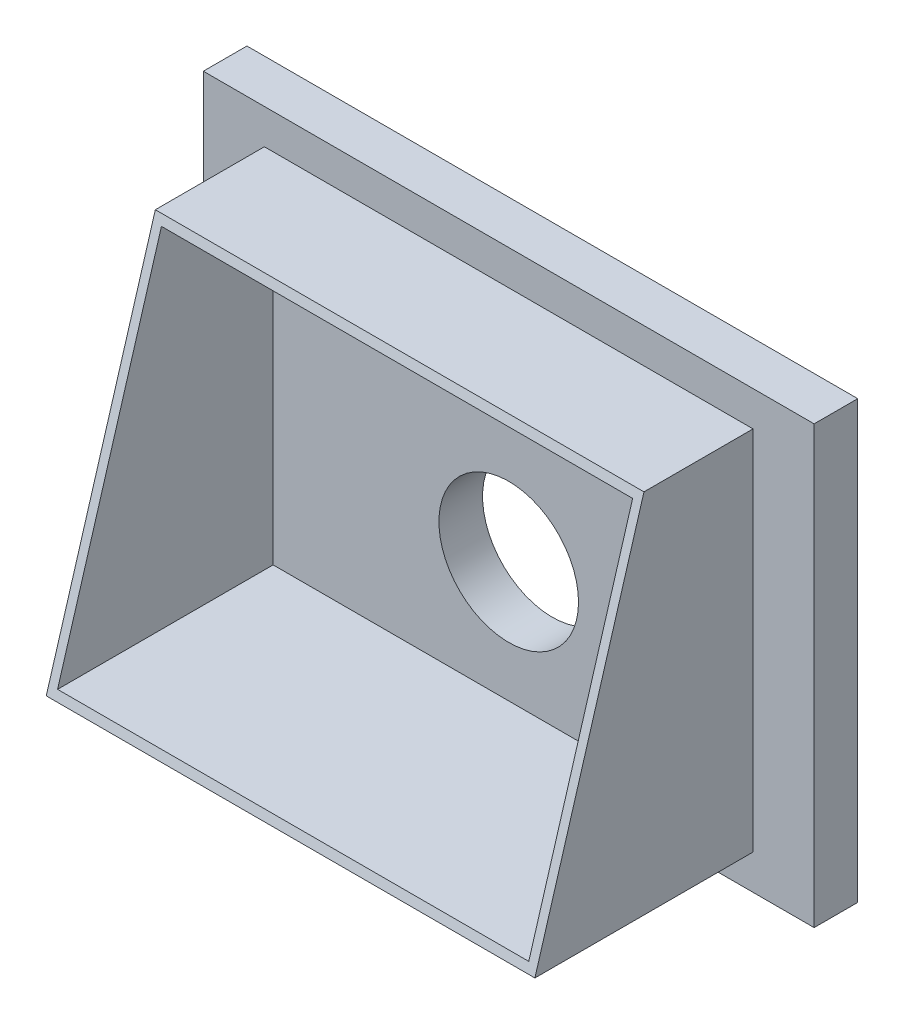
ISO-10303-21;
HEADER;
FILE_DESCRIPTION(('STEP AP214'),'2;1');
FILE_NAME('part.step','',(''),(''),'','','');
FILE_SCHEMA(('AUTOMOTIVE_DESIGN { 1 0 10303 214 1 1 1 1 }'));
ENDSEC;
DATA;
#1=APPLICATION_CONTEXT('core data for automotive mechanical design processes');
#2=APPLICATION_PROTOCOL_DEFINITION('international standard','automotive_design',2000,#1);
#3=PRODUCT_CONTEXT('',#1,'mechanical');
#4=PRODUCT('Part','Part','',(#3));
#5=PRODUCT_RELATED_PRODUCT_CATEGORY('part','',(#4));
#6=PRODUCT_DEFINITION_FORMATION('','',#4);
#7=PRODUCT_DEFINITION_CONTEXT('part definition',#1,'design');
#8=PRODUCT_DEFINITION('design','',#6,#7);
#9=PRODUCT_DEFINITION_SHAPE('','',#8);
#10=(LENGTH_UNIT() NAMED_UNIT(*) SI_UNIT(.MILLI.,.METRE.));
#11=(NAMED_UNIT(*) PLANE_ANGLE_UNIT() SI_UNIT($,.RADIAN.));
#12=(NAMED_UNIT(*) SI_UNIT($,.STERADIAN.) SOLID_ANGLE_UNIT());
#13=UNCERTAINTY_MEASURE_WITH_UNIT(LENGTH_MEASURE(1.E-05),#10,'distance_accuracy_value','');
#14=(GEOMETRIC_REPRESENTATION_CONTEXT(3) GLOBAL_UNCERTAINTY_ASSIGNED_CONTEXT((#13)) GLOBAL_UNIT_ASSIGNED_CONTEXT((#10,
#11,#12)) REPRESENTATION_CONTEXT('',''));
#15=CARTESIAN_POINT('',(0.,0.,0.));
#16=DIRECTION('',(0.,0.,1.));
#17=DIRECTION('',(1.,0.,0.));
#18=AXIS2_PLACEMENT_3D('',#15,#16,#17);
#19=CARTESIAN_POINT('',(0.,0.,50.));
#20=DIRECTION('',(0.,0.,1.));
#21=DIRECTION('',(1.,0.,0.));
#22=AXIS2_PLACEMENT_3D('',#19,#20,#21);
#23=PLANE('',#22);
#24=DIRECTION('',(0.,1.,0.));
#25=VECTOR('',#24,1.);
#26=CARTESIAN_POINT('',(349.999999999998,250.,50.));
#27=LINE('',#26,#25);
#28=CARTESIAN_POINT('',(349.999999999996,-250.,50.));
#29=VERTEX_POINT('',#28);
#30=CARTESIAN_POINT('',(349.999999999998,250.,50.));
#31=VERTEX_POINT('',#30);
#32=EDGE_CURVE('E184',#29,#31,#27,.T.);
#33=ORIENTED_EDGE('',*,*,#32,.T.);
#34=DIRECTION('',(-1.,0.,0.));
#35=VECTOR('',#34,1.);
#36=CARTESIAN_POINT('',(-350.000000000003,250.,50.));
#37=LINE('',#36,#35);
#38=CARTESIAN_POINT('',(-350.000000000003,250.,50.));
#39=VERTEX_POINT('',#38);
#40=EDGE_CURVE('E187',#31,#39,#37,.T.);
#41=ORIENTED_EDGE('',*,*,#40,.T.);
#42=DIRECTION('',(0.,-1.,0.));
#43=VECTOR('',#42,1.);
#44=CARTESIAN_POINT('',(-350.000000000003,250.,50.));
#45=LINE('',#44,#43);
#46=CARTESIAN_POINT('',(-350.000000000003,-250.,50.));
#47=VERTEX_POINT('',#46);
#48=EDGE_CURVE('E190',#39,#47,#45,.T.);
#49=ORIENTED_EDGE('',*,*,#48,.T.);
#50=DIRECTION('',(1.,0.,0.));
#51=VECTOR('',#50,1.);
#52=CARTESIAN_POINT('',(-350.000000000003,-250.,50.));
#53=LINE('',#52,#51);
#54=EDGE_CURVE('E192',#47,#29,#53,.T.);
#55=ORIENTED_EDGE('',*,*,#54,.T.);
#56=EDGE_LOOP('',(#33,#41,#49,#55));
#57=FACE_BOUND('',#56,.T.);
#58=DIRECTION('',(-1.,0.,0.));
#59=VECTOR('',#58,1.);
#60=CARTESIAN_POINT('',(-270.,210.,50.));
#61=LINE('',#60,#59);
#62=CARTESIAN_POINT('',(280.,210.,50.));
#63=VERTEX_POINT('',#62);
#64=CARTESIAN_POINT('',(-280.,210.,50.));
#65=VERTEX_POINT('',#64);
#66=EDGE_CURVE('E237',#63,#65,#61,.T.);
#67=ORIENTED_EDGE('',*,*,#66,.F.);
#68=DIRECTION('',(0.,1.,0.));
#69=VECTOR('',#68,1.);
#70=CARTESIAN_POINT('',(280.,200.,50.));
#71=LINE('',#70,#69);
#72=CARTESIAN_POINT('',(280.,-210.,50.));
#73=VERTEX_POINT('',#72);
#74=EDGE_CURVE('E238',#73,#63,#71,.T.);
#75=ORIENTED_EDGE('',*,*,#74,.F.);
#76=DIRECTION('',(1.,0.,0.));
#77=VECTOR('',#76,1.);
#78=CARTESIAN_POINT('',(-270.,-210.,50.));
#79=LINE('',#78,#77);
#80=CARTESIAN_POINT('',(-280.,-210.,50.));
#81=VERTEX_POINT('',#80);
#82=EDGE_CURVE('E162',#81,#73,#79,.T.);
#83=ORIENTED_EDGE('',*,*,#82,.F.);
#84=DIRECTION('',(0.,-1.,0.));
#85=VECTOR('',#84,1.);
#86=CARTESIAN_POINT('',(-280.,200.,50.));
#87=LINE('',#86,#85);
#88=EDGE_CURVE('E239',#65,#81,#87,.T.);
#89=ORIENTED_EDGE('',*,*,#88,.F.);
#90=EDGE_LOOP('',(#67,#75,#83,#89));
#91=FACE_BOUND('',#90,.T.);
#92=ADVANCED_FACE('F66',(#57,#91),#23,.T.);
#93=CARTESIAN_POINT('',(349.999999999998,250.,50.));
#94=DIRECTION('',(-1.,0.,0.));
#95=DIRECTION('',(0.,-1.,0.));
#96=AXIS2_PLACEMENT_3D('',#93,#94,#95);
#97=PLANE('',#96);
#98=DIRECTION('',(0.,1.,0.));
#99=VECTOR('',#98,1.);
#100=CARTESIAN_POINT('',(349.999999999998,250.,0.));
#101=LINE('',#100,#99);
#102=CARTESIAN_POINT('',(349.999999999996,-250.,0.));
#103=VERTEX_POINT('',#102);
#104=CARTESIAN_POINT('',(349.999999999998,250.,0.));
#105=VERTEX_POINT('',#104);
#106=EDGE_CURVE('E183',#103,#105,#101,.T.);
#107=ORIENTED_EDGE('',*,*,#106,.T.);
#108=DIRECTION('',(0.,0.,-1.));
#109=VECTOR('',#108,1.);
#110=CARTESIAN_POINT('',(349.999999999998,250.,50.));
#111=LINE('',#110,#109);
#112=EDGE_CURVE('E74',#31,#105,#111,.T.);
#113=ORIENTED_EDGE('',*,*,#112,.F.);
#114=ORIENTED_EDGE('',*,*,#32,.F.);
#115=DIRECTION('',(0.,0.,-1.));
#116=VECTOR('',#115,1.);
#117=CARTESIAN_POINT('',(349.999999999996,-250.,50.));
#118=LINE('',#117,#116);
#119=EDGE_CURVE('E194',#29,#103,#118,.T.);
#120=ORIENTED_EDGE('',*,*,#119,.T.);
#121=EDGE_LOOP('',(#107,#113,#114,#120));
#122=FACE_BOUND('',#121,.T.);
#123=ADVANCED_FACE('F68',(#122),#97,.F.);
#124=CARTESIAN_POINT('',(-350.000000000003,250.,50.));
#125=DIRECTION('',(0.,-1.,0.));
#126=DIRECTION('',(0.,0.,-1.));
#127=AXIS2_PLACEMENT_3D('',#124,#125,#126);
#128=PLANE('',#127);
#129=DIRECTION('',(-1.,0.,0.));
#130=VECTOR('',#129,1.);
#131=CARTESIAN_POINT('',(-350.000000000003,250.,0.));
#132=LINE('',#131,#130);
#133=CARTESIAN_POINT('',(-350.000000000003,250.,0.));
#134=VERTEX_POINT('',#133);
#135=EDGE_CURVE('E197',#105,#134,#132,.T.);
#136=ORIENTED_EDGE('',*,*,#135,.T.);
#137=DIRECTION('',(0.,0.,-1.));
#138=VECTOR('',#137,1.);
#139=CARTESIAN_POINT('',(-350.000000000003,250.,50.));
#140=LINE('',#139,#138);
#141=EDGE_CURVE('E207',#39,#134,#140,.T.);
#142=ORIENTED_EDGE('',*,*,#141,.F.);
#143=ORIENTED_EDGE('',*,*,#40,.F.);
#144=ORIENTED_EDGE('',*,*,#112,.T.);
#145=EDGE_LOOP('',(#136,#142,#143,#144));
#146=FACE_BOUND('',#145,.T.);
#147=ADVANCED_FACE('F212',(#146),#128,.F.);
#148=CARTESIAN_POINT('',(-350.000000000003,250.,50.));
#149=DIRECTION('',(1.,0.,0.));
#150=DIRECTION('',(0.,0.,-1.));
#151=AXIS2_PLACEMENT_3D('',#148,#149,#150);
#152=PLANE('',#151);
#153=DIRECTION('',(0.,-1.,0.));
#154=VECTOR('',#153,1.);
#155=CARTESIAN_POINT('',(-350.000000000003,250.,0.));
#156=LINE('',#155,#154);
#157=CARTESIAN_POINT('',(-350.000000000003,-250.,0.));
#158=VERTEX_POINT('',#157);
#159=EDGE_CURVE('E199',#134,#158,#156,.T.);
#160=ORIENTED_EDGE('',*,*,#159,.T.);
#161=DIRECTION('',(0.,0.,-1.));
#162=VECTOR('',#161,1.);
#163=CARTESIAN_POINT('',(-350.000000000003,-250.,50.));
#164=LINE('',#163,#162);
#165=EDGE_CURVE('E204',#47,#158,#164,.T.);
#166=ORIENTED_EDGE('',*,*,#165,.F.);
#167=ORIENTED_EDGE('',*,*,#48,.F.);
#168=ORIENTED_EDGE('',*,*,#141,.T.);
#169=EDGE_LOOP('',(#160,#166,#167,#168));
#170=FACE_BOUND('',#169,.T.);
#171=ADVANCED_FACE('F224',(#170),#152,.F.);
#172=CARTESIAN_POINT('',(-350.000000000003,-250.,50.));
#173=DIRECTION('',(0.,1.,0.));
#174=DIRECTION('',(0.,0.,1.));
#175=AXIS2_PLACEMENT_3D('',#172,#173,#174);
#176=PLANE('',#175);
#177=DIRECTION('',(1.,0.,0.));
#178=VECTOR('',#177,1.);
#179=CARTESIAN_POINT('',(-350.000000000003,-250.,0.));
#180=LINE('',#179,#178);
#181=EDGE_CURVE('E188',#158,#103,#180,.T.);
#182=ORIENTED_EDGE('',*,*,#181,.T.);
#183=ORIENTED_EDGE('',*,*,#119,.F.);
#184=ORIENTED_EDGE('',*,*,#54,.F.);
#185=ORIENTED_EDGE('',*,*,#165,.T.);
#186=EDGE_LOOP('',(#182,#183,#184,#185));
#187=FACE_BOUND('',#186,.T.);
#188=ADVANCED_FACE('F228',(#187),#176,.F.);
#189=CARTESIAN_POINT('',(0.,0.,0.));
#190=DIRECTION('',(0.,0.,1.));
#191=DIRECTION('',(1.,0.,0.));
#192=AXIS2_PLACEMENT_3D('',#189,#190,#191);
#193=PLANE('',#192);
#194=CARTESIAN_POINT('',(1.25951316527428E-12,-62.0000000000002,0.));
#195=DIRECTION('',(0.,0.,1.));
#196=DIRECTION('',(1.,0.,0.));
#197=AXIS2_PLACEMENT_3D('',#194,#195,#196);
#198=CIRCLE('',#197,80.);
#199=CARTESIAN_POINT('',(80.0000000000013,-62.0000000000002,0.));
#200=VERTEX_POINT('',#199);
#201=EDGE_CURVE('E272',#200,#200,#198,.T.);
#202=ORIENTED_EDGE('',*,*,#201,.T.);
#203=EDGE_LOOP('',(#202));
#204=FACE_BOUND('',#203,.T.);
#205=ORIENTED_EDGE('',*,*,#106,.F.);
#206=ORIENTED_EDGE('',*,*,#181,.F.);
#207=ORIENTED_EDGE('',*,*,#159,.F.);
#208=ORIENTED_EDGE('',*,*,#135,.F.);
#209=EDGE_LOOP('',(#205,#206,#207,#208));
#210=FACE_BOUND('',#209,.T.);
#211=ADVANCED_FACE('F220',(#204,#210),#193,.F.);
#212=CARTESIAN_POINT('',(280.,200.,300.));
#213=DIRECTION('',(-1.,0.,0.));
#214=DIRECTION('',(0.,0.,1.));
#215=AXIS2_PLACEMENT_3D('',#212,#213,#214);
#216=PLANE('',#215);
#217=DIRECTION('',(0.,0.,-1.));
#218=VECTOR('',#217,1.);
#219=CARTESIAN_POINT('',(280.,210.,300.));
#220=LINE('',#219,#218);
#221=CARTESIAN_POINT('',(280.,210.,175.));
#222=VERTEX_POINT('',#221);
#223=EDGE_CURVE('E170',#222,#63,#220,.T.);
#224=ORIENTED_EDGE('',*,*,#223,.F.);
#225=DIRECTION('',(0.,-0.958452078441276,0.285253594774189));
#226=VECTOR('',#225,1.);
#227=CARTESIAN_POINT('',(280.,166.638458534045,187.905220674391));
#228=LINE('',#227,#226);
#229=CARTESIAN_POINT('',(280.,-210.,300.));
#230=VERTEX_POINT('',#229);
#231=EDGE_CURVE('E156',#222,#230,#228,.T.);
#232=ORIENTED_EDGE('',*,*,#231,.T.);
#233=DIRECTION('',(0.,0.,-1.));
#234=VECTOR('',#233,1.);
#235=CARTESIAN_POINT('',(280.,-210.,300.));
#236=LINE('',#235,#234);
#237=EDGE_CURVE('E161',#230,#73,#236,.T.);
#238=ORIENTED_EDGE('',*,*,#237,.T.);
#239=ORIENTED_EDGE('',*,*,#74,.T.);
#240=EDGE_LOOP('',(#224,#232,#238,#239));
#241=FACE_BOUND('',#240,.T.);
#242=ADVANCED_FACE('F167',(#241),#216,.F.);
#243=CARTESIAN_POINT('',(-270.,210.,300.));
#244=DIRECTION('',(0.,-1.,0.));
#245=DIRECTION('',(0.,0.,-1.));
#246=AXIS2_PLACEMENT_3D('',#243,#244,#245);
#247=PLANE('',#246);
#248=DIRECTION('',(0.,0.,-1.));
#249=VECTOR('',#248,1.);
#250=CARTESIAN_POINT('',(-280.,210.,300.));
#251=LINE('',#250,#249);
#252=CARTESIAN_POINT('',(-280.,210.,175.));
#253=VERTEX_POINT('',#252);
#254=EDGE_CURVE('E176',#253,#65,#251,.T.);
#255=ORIENTED_EDGE('',*,*,#254,.F.);
#256=DIRECTION('',(-1.,0.,0.));
#257=VECTOR('',#256,1.);
#258=CARTESIAN_POINT('',(349.999999999998,210.,175.));
#259=LINE('',#258,#257);
#260=EDGE_CURVE('E270',#222,#253,#259,.T.);
#261=ORIENTED_EDGE('',*,*,#260,.F.);
#262=ORIENTED_EDGE('',*,*,#223,.T.);
#263=ORIENTED_EDGE('',*,*,#66,.T.);
#264=EDGE_LOOP('',(#255,#261,#262,#263));
#265=FACE_BOUND('',#264,.T.);
#266=ADVANCED_FACE('F319',(#265),#247,.F.);
#267=CARTESIAN_POINT('',(-280.,200.,300.));
#268=DIRECTION('',(1.,0.,0.));
#269=DIRECTION('',(0.,0.,-1.));
#270=AXIS2_PLACEMENT_3D('',#267,#268,#269);
#271=PLANE('',#270);
#272=DIRECTION('',(0.,0.,-1.));
#273=VECTOR('',#272,1.);
#274=CARTESIAN_POINT('',(-280.,-210.,300.));
#275=LINE('',#274,#273);
#276=CARTESIAN_POINT('',(-280.,-210.,300.));
#277=VERTEX_POINT('',#276);
#278=EDGE_CURVE('E88',#277,#81,#275,.T.);
#279=ORIENTED_EDGE('',*,*,#278,.F.);
#280=DIRECTION('',(0.,0.958452078441276,-0.285253594774189));
#281=VECTOR('',#280,1.);
#282=CARTESIAN_POINT('',(-280.,166.638458534045,187.905220674391));
#283=LINE('',#282,#281);
#284=EDGE_CURVE('E159',#277,#253,#283,.T.);
#285=ORIENTED_EDGE('',*,*,#284,.T.);
#286=ORIENTED_EDGE('',*,*,#254,.T.);
#287=ORIENTED_EDGE('',*,*,#88,.T.);
#288=EDGE_LOOP('',(#279,#285,#286,#287));
#289=FACE_BOUND('',#288,.T.);
#290=ADVANCED_FACE('F316',(#289),#271,.F.);
#291=CARTESIAN_POINT('',(-270.,-210.,300.));
#292=DIRECTION('',(0.,1.,0.));
#293=DIRECTION('',(0.,0.,1.));
#294=AXIS2_PLACEMENT_3D('',#291,#292,#293);
#295=PLANE('',#294);
#296=ORIENTED_EDGE('',*,*,#82,.T.);
#297=ORIENTED_EDGE('',*,*,#237,.F.);
#298=DIRECTION('',(1.,0.,0.));
#299=VECTOR('',#298,1.);
#300=CARTESIAN_POINT('',(-270.,-210.,300.));
#301=LINE('',#300,#299);
#302=EDGE_CURVE('E153',#277,#230,#301,.T.);
#303=ORIENTED_EDGE('',*,*,#302,.F.);
#304=ORIENTED_EDGE('',*,*,#278,.T.);
#305=EDGE_LOOP('',(#296,#297,#303,#304));
#306=FACE_BOUND('',#305,.T.);
#307=ADVANCED_FACE('F173',(#306),#295,.F.);
#308=CARTESIAN_POINT('',(349.999999999998,64.9329514386148,218.174716833746));
#309=DIRECTION('',(0.,-0.285253594774189,-0.958452078441276));
#310=DIRECTION('',(0.,0.958452078441276,-0.285253594774189));
#311=AXIS2_PLACEMENT_3D('',#308,#309,#310);
#312=PLANE('',#311);
#313=DIRECTION('',(0.,-0.958452078441276,0.285253594774189));
#314=VECTOR('',#313,1.);
#315=CARTESIAN_POINT('',(270.,166.638458534045,187.905220674391));
#316=LINE('',#315,#314);
#317=CARTESIAN_POINT('',(270.,200.,177.97619047619));
#318=VERTEX_POINT('',#317);
#319=CARTESIAN_POINT('',(270.,-200.,297.023809523809));
#320=VERTEX_POINT('',#319);
#321=EDGE_CURVE('E80',#318,#320,#316,.T.);
#322=ORIENTED_EDGE('',*,*,#321,.T.);
#323=DIRECTION('',(-1.,0.,0.));
#324=VECTOR('',#323,1.);
#325=CARTESIAN_POINT('',(-270.,-200.,297.023809523809));
#326=LINE('',#325,#324);
#327=CARTESIAN_POINT('',(-270.,-200.,297.023809523809));
#328=VERTEX_POINT('',#327);
#329=EDGE_CURVE('E12',#320,#328,#326,.T.);
#330=ORIENTED_EDGE('',*,*,#329,.T.);
#331=DIRECTION('',(0.,0.958452078441276,-0.285253594774189));
#332=VECTOR('',#331,1.);
#333=CARTESIAN_POINT('',(-270.,166.638458534045,187.905220674391));
#334=LINE('',#333,#332);
#335=CARTESIAN_POINT('',(-270.,200.,177.97619047619));
#336=VERTEX_POINT('',#335);
#337=EDGE_CURVE('E268',#328,#336,#334,.T.);
#338=ORIENTED_EDGE('',*,*,#337,.T.);
#339=DIRECTION('',(1.,0.,0.));
#340=VECTOR('',#339,1.);
#341=CARTESIAN_POINT('',(-270.,200.,177.97619047619));
#342=LINE('',#341,#340);
#343=EDGE_CURVE('E266',#336,#318,#342,.T.);
#344=ORIENTED_EDGE('',*,*,#343,.T.);
#345=EDGE_LOOP('',(#322,#330,#338,#344));
#346=FACE_BOUND('',#345,.T.);
#347=ORIENTED_EDGE('',*,*,#260,.T.);
#348=ORIENTED_EDGE('',*,*,#284,.F.);
#349=ORIENTED_EDGE('',*,*,#302,.T.);
#350=ORIENTED_EDGE('',*,*,#231,.F.);
#351=EDGE_LOOP('',(#347,#348,#349,#350));
#352=FACE_BOUND('',#351,.T.);
#353=ADVANCED_FACE('F155',(#346,#352),#312,.F.);
#354=CARTESIAN_POINT('',(1.25951316527428E-12,-62.0000000000002,50.));
#355=DIRECTION('',(0.,0.,1.));
#356=DIRECTION('',(1.,0.,0.));
#357=AXIS2_PLACEMENT_3D('',#354,#355,#356);
#358=CIRCLE('',#357,80.);
#359=CARTESIAN_POINT('',(80.0000000000013,-62.0000000000002,50.));
#360=VERTEX_POINT('',#359);
#361=EDGE_CURVE('E273',#360,#360,#358,.T.);
#362=ORIENTED_EDGE('',*,*,#361,.F.);
#363=EDGE_LOOP('',(#362));
#364=FACE_BOUND('',#363,.T.);
#365=DIRECTION('',(0.,1.,0.));
#366=VECTOR('',#365,1.);
#367=CARTESIAN_POINT('',(270.,200.,50.));
#368=LINE('',#367,#366);
#369=CARTESIAN_POINT('',(270.,-200.,50.));
#370=VERTEX_POINT('',#369);
#371=CARTESIAN_POINT('',(270.,200.,50.));
#372=VERTEX_POINT('',#371);
#373=EDGE_CURVE('E171',#370,#372,#368,.T.);
#374=ORIENTED_EDGE('',*,*,#373,.T.);
#375=DIRECTION('',(-1.,0.,0.));
#376=VECTOR('',#375,1.);
#377=CARTESIAN_POINT('',(-270.,200.,50.));
#378=LINE('',#377,#376);
#379=CARTESIAN_POINT('',(-270.,200.,50.));
#380=VERTEX_POINT('',#379);
#381=EDGE_CURVE('E259',#372,#380,#378,.T.);
#382=ORIENTED_EDGE('',*,*,#381,.T.);
#383=DIRECTION('',(0.,-1.,0.));
#384=VECTOR('',#383,1.);
#385=CARTESIAN_POINT('',(-270.,200.,50.));
#386=LINE('',#385,#384);
#387=CARTESIAN_POINT('',(-270.,-200.,50.));
#388=VERTEX_POINT('',#387);
#389=EDGE_CURVE('E256',#380,#388,#386,.T.);
#390=ORIENTED_EDGE('',*,*,#389,.T.);
#391=DIRECTION('',(1.,0.,0.));
#392=VECTOR('',#391,1.);
#393=CARTESIAN_POINT('',(-270.,-200.,50.));
#394=LINE('',#393,#392);
#395=EDGE_CURVE('E253',#388,#370,#394,.T.);
#396=ORIENTED_EDGE('',*,*,#395,.T.);
#397=EDGE_LOOP('',(#374,#382,#390,#396));
#398=FACE_BOUND('',#397,.T.);
#399=ADVANCED_FACE('F233',(#364,#398),#23,.T.);
#400=CARTESIAN_POINT('',(-270.,-200.,300.));
#401=DIRECTION('',(0.,1.,0.));
#402=DIRECTION('',(0.,0.,1.));
#403=AXIS2_PLACEMENT_3D('',#400,#401,#402);
#404=PLANE('',#403);
#405=ORIENTED_EDGE('',*,*,#329,.F.);
#406=DIRECTION('',(0.,0.,-1.));
#407=VECTOR('',#406,1.);
#408=CARTESIAN_POINT('',(270.,-200.,300.));
#409=LINE('',#408,#407);
#410=EDGE_CURVE('E251',#320,#370,#409,.T.);
#411=ORIENTED_EDGE('',*,*,#410,.T.);
#412=ORIENTED_EDGE('',*,*,#395,.F.);
#413=DIRECTION('',(0.,0.,-1.));
#414=VECTOR('',#413,1.);
#415=CARTESIAN_POINT('',(-270.,-200.,300.));
#416=LINE('',#415,#414);
#417=EDGE_CURVE('E249',#328,#388,#416,.T.);
#418=ORIENTED_EDGE('',*,*,#417,.F.);
#419=EDGE_LOOP('',(#405,#411,#412,#418));
#420=FACE_BOUND('',#419,.T.);
#421=ADVANCED_FACE('F289',(#420),#404,.T.);
#422=CARTESIAN_POINT('',(-270.,200.,300.));
#423=DIRECTION('',(1.,0.,0.));
#424=DIRECTION('',(0.,0.,-1.));
#425=AXIS2_PLACEMENT_3D('',#422,#423,#424);
#426=PLANE('',#425);
#427=ORIENTED_EDGE('',*,*,#337,.F.);
#428=ORIENTED_EDGE('',*,*,#417,.T.);
#429=ORIENTED_EDGE('',*,*,#389,.F.);
#430=DIRECTION('',(0.,0.,-1.));
#431=VECTOR('',#430,1.);
#432=CARTESIAN_POINT('',(-270.,200.,300.));
#433=LINE('',#432,#431);
#434=EDGE_CURVE('E247',#336,#380,#433,.T.);
#435=ORIENTED_EDGE('',*,*,#434,.F.);
#436=EDGE_LOOP('',(#427,#428,#429,#435));
#437=FACE_BOUND('',#436,.T.);
#438=ADVANCED_FACE('F303',(#437),#426,.T.);
#439=CARTESIAN_POINT('',(-270.,200.,300.));
#440=DIRECTION('',(0.,-1.,0.));
#441=DIRECTION('',(0.,0.,-1.));
#442=AXIS2_PLACEMENT_3D('',#439,#440,#441);
#443=PLANE('',#442);
#444=ORIENTED_EDGE('',*,*,#343,.F.);
#445=ORIENTED_EDGE('',*,*,#434,.T.);
#446=ORIENTED_EDGE('',*,*,#381,.F.);
#447=DIRECTION('',(0.,0.,-1.));
#448=VECTOR('',#447,1.);
#449=CARTESIAN_POINT('',(270.,200.,300.));
#450=LINE('',#449,#448);
#451=EDGE_CURVE('E243',#318,#372,#450,.T.);
#452=ORIENTED_EDGE('',*,*,#451,.F.);
#453=EDGE_LOOP('',(#444,#445,#446,#452));
#454=FACE_BOUND('',#453,.T.);
#455=ADVANCED_FACE('F299',(#454),#443,.T.);
#456=CARTESIAN_POINT('',(270.,200.,300.));
#457=DIRECTION('',(-1.,0.,0.));
#458=DIRECTION('',(0.,0.,1.));
#459=AXIS2_PLACEMENT_3D('',#456,#457,#458);
#460=PLANE('',#459);
#461=ORIENTED_EDGE('',*,*,#321,.F.);
#462=ORIENTED_EDGE('',*,*,#451,.T.);
#463=ORIENTED_EDGE('',*,*,#373,.F.);
#464=ORIENTED_EDGE('',*,*,#410,.F.);
#465=EDGE_LOOP('',(#461,#462,#463,#464));
#466=FACE_BOUND('',#465,.T.);
#467=ADVANCED_FACE('F283',(#466),#460,.T.);
#468=CARTESIAN_POINT('',(1.25951316527428E-12,-62.0000000000002,0.));
#469=DIRECTION('',(0.,0.,1.));
#470=DIRECTION('',(1.,0.,0.));
#471=AXIS2_PLACEMENT_3D('',#468,#469,#470);
#472=CYLINDRICAL_SURFACE('',#471,80.);
#473=ORIENTED_EDGE('',*,*,#201,.F.);
#474=EDGE_LOOP('',(#473));
#475=FACE_BOUND('',#474,.T.);
#476=ORIENTED_EDGE('',*,*,#361,.T.);
#477=EDGE_LOOP('',(#476));
#478=FACE_BOUND('',#477,.T.);
#479=ADVANCED_FACE('F280',(#475,#478),#472,.F.);
#480=CLOSED_SHELL('',(#92,#123,#147,#171,#188,#211,#242,#266,#290,#307,#353,#399,#421,#438,#455,
#467,#479));
#481=MANIFOLD_SOLID_BREP('B2',#480);
#482=ADVANCED_BREP_SHAPE_REPRESENTATION('',(#18,#481),#14);
#483=SHAPE_DEFINITION_REPRESENTATION(#9,#482);
ENDSEC;
END-ISO-10303-21;
